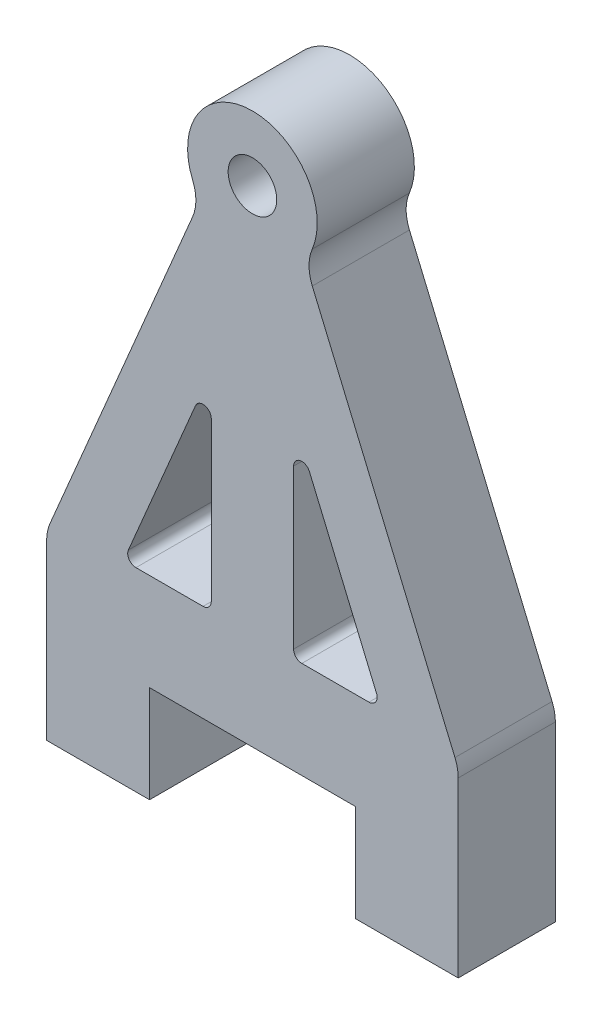
ISO-10303-21;
HEADER;
FILE_DESCRIPTION(('STEP AP214'),'2;1');
FILE_NAME('part.step','',(''),(''),'','','');
FILE_SCHEMA(('AUTOMOTIVE_DESIGN { 1 0 10303 214 1 1 1 1 }'));
ENDSEC;
DATA;
#1=APPLICATION_CONTEXT('core data for automotive mechanical design processes');
#2=APPLICATION_PROTOCOL_DEFINITION('international standard','automotive_design',2000,#1);
#3=PRODUCT_CONTEXT('',#1,'mechanical');
#4=PRODUCT('Part','Part','',(#3));
#5=PRODUCT_RELATED_PRODUCT_CATEGORY('part','',(#4));
#6=PRODUCT_DEFINITION_FORMATION('','',#4);
#7=PRODUCT_DEFINITION_CONTEXT('part definition',#1,'design');
#8=PRODUCT_DEFINITION('design','',#6,#7);
#9=PRODUCT_DEFINITION_SHAPE('','',#8);
#10=(LENGTH_UNIT() NAMED_UNIT(*) SI_UNIT(.MILLI.,.METRE.));
#11=(NAMED_UNIT(*) PLANE_ANGLE_UNIT() SI_UNIT($,.RADIAN.));
#12=(NAMED_UNIT(*) SI_UNIT($,.STERADIAN.) SOLID_ANGLE_UNIT());
#13=UNCERTAINTY_MEASURE_WITH_UNIT(LENGTH_MEASURE(1.E-05),#10,'distance_accuracy_value','');
#14=(GEOMETRIC_REPRESENTATION_CONTEXT(3) GLOBAL_UNCERTAINTY_ASSIGNED_CONTEXT((#13)) GLOBAL_UNIT_ASSIGNED_CONTEXT((#10,
#11,#12)) REPRESENTATION_CONTEXT('',''));
#15=CARTESIAN_POINT('',(0.,0.,0.));
#16=DIRECTION('',(0.,0.,1.));
#17=DIRECTION('',(1.,0.,0.));
#18=AXIS2_PLACEMENT_3D('',#15,#16,#17);
#19=CARTESIAN_POINT('',(-6.03331121194558,-2.52403562173988,5.9944));
#20=DIRECTION('',(0.,0.,1.));
#21=DIRECTION('',(1.,0.,0.));
#22=AXIS2_PLACEMENT_3D('',#19,#20,#21);
#23=PLANE('',#22);
#24=CARTESIAN_POINT('',(-6.03331121194558,-2.52403562173988,5.9944));
#25=DIRECTION('',(0.,0.,-1.));
#26=DIRECTION('',(1.,0.,0.));
#27=AXIS2_PLACEMENT_3D('',#24,#25,#26);
#28=CIRCLE('',#27,2.54);
#29=CARTESIAN_POINT('',(-3.69009860057833,-1.54375267384702,5.9944));
#30=VERTEX_POINT('',#29);
#31=CARTESIAN_POINT('',(-3.69426966875646,-3.51422987502327,5.9944));
#32=VERTEX_POINT('',#31);
#33=EDGE_CURVE('E308',#30,#32,#28,.T.);
#34=ORIENTED_EDGE('',*,*,#33,.T.);
#35=DIRECTION('',(-0.389840257198186,-0.920882497318551,0.));
#36=VECTOR('',#35,1.);
#37=CARTESIAN_POINT('',(-3.69426966875646,-3.51422987502327,5.9944));
#38=LINE('',#37,#36);
#39=CARTESIAN_POINT('',(-12.4990415431891,-24.3129035941556,5.9944));
#40=VERTEX_POINT('',#39);
#41=EDGE_CURVE('E311',#32,#40,#38,.T.);
#42=ORIENTED_EDGE('',*,*,#41,.T.);
#43=CARTESIAN_POINT('',(-10.16,-25.303097847439,5.9944));
#44=DIRECTION('',(0.,0.,1.));
#45=DIRECTION('',(1.,0.,0.));
#46=AXIS2_PLACEMENT_3D('',#43,#44,#45);
#47=CIRCLE('',#46,2.54);
#48=CARTESIAN_POINT('',(-12.7,-25.303097847439,5.9944));
#49=VERTEX_POINT('',#48);
#50=EDGE_CURVE('E314',#40,#49,#47,.T.);
#51=ORIENTED_EDGE('',*,*,#50,.T.);
#52=DIRECTION('',(0.,-1.,0.));
#53=VECTOR('',#52,1.);
#54=CARTESIAN_POINT('',(-12.7,-25.303097847439,5.9944));
#55=LINE('',#54,#53);
#56=CARTESIAN_POINT('',(-12.7,-35.9944,5.9944));
#57=VERTEX_POINT('',#56);
#58=EDGE_CURVE('E316',#49,#57,#55,.T.);
#59=ORIENTED_EDGE('',*,*,#58,.T.);
#60=DIRECTION('',(1.,0.,0.));
#61=VECTOR('',#60,1.);
#62=CARTESIAN_POINT('',(-12.7,-35.9944,5.9944));
#63=LINE('',#62,#61);
#64=CARTESIAN_POINT('',(-6.35000000000001,-35.9944,5.9944));
#65=VERTEX_POINT('',#64);
#66=EDGE_CURVE('E318',#57,#65,#63,.T.);
#67=ORIENTED_EDGE('',*,*,#66,.T.);
#68=DIRECTION('',(0.,1.,0.));
#69=VECTOR('',#68,1.);
#70=CARTESIAN_POINT('',(-6.35000000000001,-35.9944,5.9944));
#71=LINE('',#70,#69);
#72=CARTESIAN_POINT('',(-6.35000000000001,-30.,5.9944));
#73=VERTEX_POINT('',#72);
#74=EDGE_CURVE('E320',#65,#73,#71,.T.);
#75=ORIENTED_EDGE('',*,*,#74,.T.);
#76=DIRECTION('',(1.,0.,0.));
#77=VECTOR('',#76,1.);
#78=CARTESIAN_POINT('',(-6.35000000000001,-30.,5.9944));
#79=LINE('',#78,#77);
#80=CARTESIAN_POINT('',(6.35,-30.,5.9944));
#81=VERTEX_POINT('',#80);
#82=EDGE_CURVE('E322',#73,#81,#79,.T.);
#83=ORIENTED_EDGE('',*,*,#82,.T.);
#84=DIRECTION('',(0.,-1.,0.));
#85=VECTOR('',#84,1.);
#86=CARTESIAN_POINT('',(6.35,-35.9944,5.9944));
#87=LINE('',#86,#85);
#88=CARTESIAN_POINT('',(6.35,-35.9944,5.9944));
#89=VERTEX_POINT('',#88);
#90=EDGE_CURVE('E324',#81,#89,#87,.T.);
#91=ORIENTED_EDGE('',*,*,#90,.T.);
#92=DIRECTION('',(1.,0.,0.));
#93=VECTOR('',#92,1.);
#94=CARTESIAN_POINT('',(12.7,-35.9944,5.9944));
#95=LINE('',#94,#93);
#96=CARTESIAN_POINT('',(12.7,-35.9944,5.9944));
#97=VERTEX_POINT('',#96);
#98=EDGE_CURVE('E326',#89,#97,#95,.T.);
#99=ORIENTED_EDGE('',*,*,#98,.T.);
#100=DIRECTION('',(0.,1.,0.));
#101=VECTOR('',#100,1.);
#102=CARTESIAN_POINT('',(12.7,-30.,5.9944));
#103=LINE('',#102,#101);
#104=CARTESIAN_POINT('',(12.7,-25.303097847439,5.9944));
#105=VERTEX_POINT('',#104);
#106=EDGE_CURVE('E328',#97,#105,#103,.T.);
#107=ORIENTED_EDGE('',*,*,#106,.T.);
#108=CARTESIAN_POINT('',(10.16,-25.303097847439,5.9944));
#109=DIRECTION('',(0.,0.,1.));
#110=DIRECTION('',(-1.,0.,0.));
#111=AXIS2_PLACEMENT_3D('',#108,#109,#110);
#112=CIRCLE('',#111,2.54);
#113=CARTESIAN_POINT('',(12.4990415431891,-24.3129035941556,5.9944));
#114=VERTEX_POINT('',#113);
#115=EDGE_CURVE('E330',#105,#114,#112,.T.);
#116=ORIENTED_EDGE('',*,*,#115,.T.);
#117=DIRECTION('',(-0.389840257198187,0.920882497318551,0.));
#118=VECTOR('',#117,1.);
#119=CARTESIAN_POINT('',(3.69426966875645,-3.51422987502327,5.9944));
#120=LINE('',#119,#118);
#121=CARTESIAN_POINT('',(3.69426966875645,-3.51422987502327,5.9944));
#122=VERTEX_POINT('',#121);
#123=EDGE_CURVE('E332',#114,#122,#120,.T.);
#124=ORIENTED_EDGE('',*,*,#123,.T.);
#125=CARTESIAN_POINT('',(6.03331121194558,-2.52403562173987,5.9944));
#126=DIRECTION('',(0.,0.,-1.));
#127=DIRECTION('',(-1.,0.,0.));
#128=AXIS2_PLACEMENT_3D('',#125,#126,#127);
#129=CIRCLE('',#128,2.54);
#130=CARTESIAN_POINT('',(3.69009860057833,-1.54375267384702,5.9944));
#131=VERTEX_POINT('',#130);
#132=EDGE_CURVE('E334',#122,#131,#129,.T.);
#133=ORIENTED_EDGE('',*,*,#132,.T.);
#134=CARTESIAN_POINT('',(0.,0.,5.9944));
#135=DIRECTION('',(0.,0.,1.));
#136=DIRECTION('',(1.,0.,0.));
#137=AXIS2_PLACEMENT_3D('',#134,#135,#136);
#138=CIRCLE('',#137,4.);
#139=EDGE_CURVE('E336',#131,#30,#138,.T.);
#140=ORIENTED_EDGE('',*,*,#139,.T.);
#141=EDGE_LOOP('',(#34,#42,#51,#59,#67,#75,#83,#91,#99,#107,#116,#124,#133,#140));
#142=FACE_BOUND('',#141,.T.);
#143=CARTESIAN_POINT('',(0.,0.,5.9944));
#144=DIRECTION('',(0.,0.,1.));
#145=DIRECTION('',(1.,0.,0.));
#146=AXIS2_PLACEMENT_3D('',#143,#144,#145);
#147=CIRCLE('',#146,1.5);
#148=CARTESIAN_POINT('',(1.5,0.,5.9944));
#149=VERTEX_POINT('',#148);
#150=EDGE_CURVE('E302',#149,#149,#147,.T.);
#151=ORIENTED_EDGE('',*,*,#150,.F.);
#152=EDGE_LOOP('',(#151));
#153=FACE_BOUND('',#152,.T.);
#154=DIRECTION('',(-0.389840257198187,-0.920882497318551,0.));
#155=VECTOR('',#154,1.);
#156=CARTESIAN_POINT('',(-3.51580830863784,-13.5174503865381,5.9944));
#157=LINE('',#156,#155);
#158=CARTESIAN_POINT('',(-3.51580830863784,-13.5174503865381,5.9944));
#159=VERTEX_POINT('',#158);
#160=CARTESIAN_POINT('',(-7.65690186489207,-23.2995611493433,5.9944));
#161=VERTEX_POINT('',#160);
#162=EDGE_CURVE('E259',#159,#161,#157,.T.);
#163=ORIENTED_EDGE('',*,*,#162,.F.);
#164=CARTESIAN_POINT('',(-3.048,-13.7154892371947,5.9944));
#165=DIRECTION('',(0.,0.,1.));
#166=DIRECTION('',(1.,0.,0.));
#167=AXIS2_PLACEMENT_3D('',#164,#165,#166);
#168=CIRCLE('',#167,0.508);
#169=CARTESIAN_POINT('',(-2.54,-13.7154892371947,5.9944));
#170=VERTEX_POINT('',#169);
#171=EDGE_CURVE('E257',#170,#159,#168,.T.);
#172=ORIENTED_EDGE('',*,*,#171,.F.);
#173=DIRECTION('',(0.,1.,0.));
#174=VECTOR('',#173,1.);
#175=CARTESIAN_POINT('',(-2.54,-13.7154892371947,5.9944));
#176=LINE('',#175,#174);
#177=CARTESIAN_POINT('',(-2.54,-23.4976,5.9944));
#178=VERTEX_POINT('',#177);
#179=EDGE_CURVE('E269',#178,#170,#176,.T.);
#180=ORIENTED_EDGE('',*,*,#179,.F.);
#181=CARTESIAN_POINT('',(-3.048,-23.4976,5.9944));
#182=DIRECTION('',(0.,0.,1.));
#183=DIRECTION('',(1.,0.,0.));
#184=AXIS2_PLACEMENT_3D('',#181,#182,#183);
#185=CIRCLE('',#184,0.507999999999999);
#186=CARTESIAN_POINT('',(-3.048,-24.0056,5.9944));
#187=VERTEX_POINT('',#186);
#188=EDGE_CURVE('E266',#187,#178,#185,.T.);
#189=ORIENTED_EDGE('',*,*,#188,.F.);
#190=DIRECTION('',(1.,0.,0.));
#191=VECTOR('',#190,1.);
#192=CARTESIAN_POINT('',(-3.048,-24.0056,5.9944));
#193=LINE('',#192,#191);
#194=CARTESIAN_POINT('',(-7.18909355625424,-24.0056,5.9944));
#195=VERTEX_POINT('',#194);
#196=EDGE_CURVE('E264',#195,#187,#193,.T.);
#197=ORIENTED_EDGE('',*,*,#196,.F.);
#198=CARTESIAN_POINT('',(-7.18909355625424,-23.4976,5.9944));
#199=DIRECTION('',(0.,0.,1.));
#200=DIRECTION('',(1.,0.,0.));
#201=AXIS2_PLACEMENT_3D('',#198,#199,#200);
#202=CIRCLE('',#201,0.508);
#203=EDGE_CURVE('E262',#161,#195,#202,.T.);
#204=ORIENTED_EDGE('',*,*,#203,.F.);
#205=EDGE_LOOP('',(#163,#172,#180,#189,#197,#204));
#206=FACE_BOUND('',#205,.T.);
#207=DIRECTION('',(0.,-1.,0.));
#208=VECTOR('',#207,1.);
#209=CARTESIAN_POINT('',(2.54,-13.7154892371947,5.9944));
#210=LINE('',#209,#208);
#211=CARTESIAN_POINT('',(2.54,-13.7154892371947,5.9944));
#212=VERTEX_POINT('',#211);
#213=CARTESIAN_POINT('',(2.54,-23.4976,5.9944));
#214=VERTEX_POINT('',#213);
#215=EDGE_CURVE('E214',#212,#214,#210,.T.);
#216=ORIENTED_EDGE('',*,*,#215,.F.);
#217=CARTESIAN_POINT('',(3.048,-13.7154892371947,5.9944));
#218=DIRECTION('',(0.,0.,1.));
#219=DIRECTION('',(-1.,0.,0.));
#220=AXIS2_PLACEMENT_3D('',#217,#218,#219);
#221=CIRCLE('',#220,0.508);
#222=CARTESIAN_POINT('',(3.51580830863784,-13.5174503865381,5.9944));
#223=VERTEX_POINT('',#222);
#224=EDGE_CURVE('E206',#223,#212,#221,.T.);
#225=ORIENTED_EDGE('',*,*,#224,.F.);
#226=DIRECTION('',(-0.389840257198187,0.920882497318551,0.));
#227=VECTOR('',#226,1.);
#228=CARTESIAN_POINT('',(3.51580830863784,-13.5174503865381,5.9944));
#229=LINE('',#228,#227);
#230=CARTESIAN_POINT('',(7.65690186489207,-23.2995611493433,5.9944));
#231=VERTEX_POINT('',#230);
#232=EDGE_CURVE('E235',#231,#223,#229,.T.);
#233=ORIENTED_EDGE('',*,*,#232,.F.);
#234=CARTESIAN_POINT('',(7.18909355625424,-23.4976,5.9944));
#235=DIRECTION('',(0.,0.,1.));
#236=DIRECTION('',(-1.,0.,0.));
#237=AXIS2_PLACEMENT_3D('',#234,#235,#236);
#238=CIRCLE('',#237,0.508);
#239=CARTESIAN_POINT('',(7.18909355625424,-24.0056,5.9944));
#240=VERTEX_POINT('',#239);
#241=EDGE_CURVE('E233',#240,#231,#238,.T.);
#242=ORIENTED_EDGE('',*,*,#241,.F.);
#243=DIRECTION('',(1.,0.,0.));
#244=VECTOR('',#243,1.);
#245=CARTESIAN_POINT('',(7.18909355625424,-24.0056,5.9944));
#246=LINE('',#245,#244);
#247=CARTESIAN_POINT('',(3.048,-24.0056,5.9944));
#248=VERTEX_POINT('',#247);
#249=EDGE_CURVE('E229',#248,#240,#246,.T.);
#250=ORIENTED_EDGE('',*,*,#249,.F.);
#251=CARTESIAN_POINT('',(3.048,-23.4976,5.9944));
#252=DIRECTION('',(0.,0.,1.));
#253=DIRECTION('',(1.,0.,0.));
#254=AXIS2_PLACEMENT_3D('',#251,#252,#253);
#255=CIRCLE('',#254,0.507999999999999);
#256=EDGE_CURVE('E227',#214,#248,#255,.T.);
#257=ORIENTED_EDGE('',*,*,#256,.F.);
#258=EDGE_LOOP('',(#216,#225,#233,#242,#250,#257));
#259=FACE_BOUND('',#258,.T.);
#260=ADVANCED_FACE('F33',(#142,#153,#206,#259),#23,.T.);
#261=CARTESIAN_POINT('',(-6.03331121194558,-2.52403562173988,0.));
#262=DIRECTION('',(0.,0.,1.));
#263=DIRECTION('',(1.,0.,0.));
#264=AXIS2_PLACEMENT_3D('',#261,#262,#263);
#265=PLANE('',#264);
#266=CARTESIAN_POINT('',(-3.048,-13.7154892371947,0.));
#267=DIRECTION('',(0.,0.,1.));
#268=DIRECTION('',(1.,0.,0.));
#269=AXIS2_PLACEMENT_3D('',#266,#267,#268);
#270=CIRCLE('',#269,0.508);
#271=CARTESIAN_POINT('',(-2.54,-13.7154892371947,0.));
#272=VERTEX_POINT('',#271);
#273=CARTESIAN_POINT('',(-3.51580830863784,-13.5174503865381,0.));
#274=VERTEX_POINT('',#273);
#275=EDGE_CURVE('E222',#272,#274,#270,.T.);
#276=ORIENTED_EDGE('',*,*,#275,.T.);
#277=DIRECTION('',(-0.389840257198187,-0.920882497318551,0.));
#278=VECTOR('',#277,1.);
#279=CARTESIAN_POINT('',(-3.51580830863784,-13.5174503865381,0.));
#280=LINE('',#279,#278);
#281=CARTESIAN_POINT('',(-7.65690186489207,-23.2995611493433,0.));
#282=VERTEX_POINT('',#281);
#283=EDGE_CURVE('E274',#274,#282,#280,.T.);
#284=ORIENTED_EDGE('',*,*,#283,.T.);
#285=CARTESIAN_POINT('',(-7.18909355625424,-23.4976,0.));
#286=DIRECTION('',(0.,0.,1.));
#287=DIRECTION('',(1.,0.,0.));
#288=AXIS2_PLACEMENT_3D('',#285,#286,#287);
#289=CIRCLE('',#288,0.508);
#290=CARTESIAN_POINT('',(-7.18909355625424,-24.0056,0.));
#291=VERTEX_POINT('',#290);
#292=EDGE_CURVE('E277',#282,#291,#289,.T.);
#293=ORIENTED_EDGE('',*,*,#292,.T.);
#294=DIRECTION('',(1.,0.,0.));
#295=VECTOR('',#294,1.);
#296=CARTESIAN_POINT('',(-3.048,-24.0056,0.));
#297=LINE('',#296,#295);
#298=CARTESIAN_POINT('',(-3.048,-24.0056,0.));
#299=VERTEX_POINT('',#298);
#300=EDGE_CURVE('E280',#291,#299,#297,.T.);
#301=ORIENTED_EDGE('',*,*,#300,.T.);
#302=CARTESIAN_POINT('',(-3.048,-23.4976,0.));
#303=DIRECTION('',(0.,0.,1.));
#304=DIRECTION('',(1.,0.,0.));
#305=AXIS2_PLACEMENT_3D('',#302,#303,#304);
#306=CIRCLE('',#305,0.507999999999999);
#307=CARTESIAN_POINT('',(-2.54,-23.4976,0.));
#308=VERTEX_POINT('',#307);
#309=EDGE_CURVE('E283',#299,#308,#306,.T.);
#310=ORIENTED_EDGE('',*,*,#309,.T.);
#311=DIRECTION('',(0.,1.,0.));
#312=VECTOR('',#311,1.);
#313=CARTESIAN_POINT('',(-2.54,-13.7154892371947,0.));
#314=LINE('',#313,#312);
#315=EDGE_CURVE('E260',#308,#272,#314,.T.);
#316=ORIENTED_EDGE('',*,*,#315,.T.);
#317=EDGE_LOOP('',(#276,#284,#293,#301,#310,#316));
#318=FACE_BOUND('',#317,.T.);
#319=CARTESIAN_POINT('',(-6.03331121194558,-2.52403562173988,0.));
#320=DIRECTION('',(0.,0.,-1.));
#321=DIRECTION('',(1.,0.,0.));
#322=AXIS2_PLACEMENT_3D('',#319,#320,#321);
#323=CIRCLE('',#322,2.54);
#324=CARTESIAN_POINT('',(-3.69009860057833,-1.54375267384702,0.));
#325=VERTEX_POINT('',#324);
#326=CARTESIAN_POINT('',(-3.69426966875646,-3.51422987502327,0.));
#327=VERTEX_POINT('',#326);
#328=EDGE_CURVE('E305',#325,#327,#323,.T.);
#329=ORIENTED_EDGE('',*,*,#328,.F.);
#330=CARTESIAN_POINT('',(0.,0.,0.));
#331=DIRECTION('',(0.,0.,1.));
#332=DIRECTION('',(1.,0.,0.));
#333=AXIS2_PLACEMENT_3D('',#330,#331,#332);
#334=CIRCLE('',#333,4.);
#335=CARTESIAN_POINT('',(3.69009860057833,-1.54375267384702,0.));
#336=VERTEX_POINT('',#335);
#337=EDGE_CURVE('E312',#336,#325,#334,.T.);
#338=ORIENTED_EDGE('',*,*,#337,.F.);
#339=CARTESIAN_POINT('',(6.03331121194558,-2.52403562173987,0.));
#340=DIRECTION('',(0.,0.,-1.));
#341=DIRECTION('',(-1.,0.,0.));
#342=AXIS2_PLACEMENT_3D('',#339,#340,#341);
#343=CIRCLE('',#342,2.54);
#344=CARTESIAN_POINT('',(3.69426966875645,-3.51422987502327,0.));
#345=VERTEX_POINT('',#344);
#346=EDGE_CURVE('E365',#345,#336,#343,.T.);
#347=ORIENTED_EDGE('',*,*,#346,.F.);
#348=DIRECTION('',(-0.389840257198187,0.920882497318551,0.));
#349=VECTOR('',#348,1.);
#350=CARTESIAN_POINT('',(3.69426966875645,-3.51422987502327,0.));
#351=LINE('',#350,#349);
#352=CARTESIAN_POINT('',(12.4990415431891,-24.3129035941556,0.));
#353=VERTEX_POINT('',#352);
#354=EDGE_CURVE('E363',#353,#345,#351,.T.);
#355=ORIENTED_EDGE('',*,*,#354,.F.);
#356=CARTESIAN_POINT('',(10.16,-25.303097847439,0.));
#357=DIRECTION('',(0.,0.,1.));
#358=DIRECTION('',(-1.,0.,0.));
#359=AXIS2_PLACEMENT_3D('',#356,#357,#358);
#360=CIRCLE('',#359,2.54);
#361=CARTESIAN_POINT('',(12.7,-25.303097847439,0.));
#362=VERTEX_POINT('',#361);
#363=EDGE_CURVE('E361',#362,#353,#360,.T.);
#364=ORIENTED_EDGE('',*,*,#363,.F.);
#365=DIRECTION('',(0.,1.,0.));
#366=VECTOR('',#365,1.);
#367=CARTESIAN_POINT('',(12.7,-30.,0.));
#368=LINE('',#367,#366);
#369=CARTESIAN_POINT('',(12.7,-35.9944,0.));
#370=VERTEX_POINT('',#369);
#371=EDGE_CURVE('E359',#370,#362,#368,.T.);
#372=ORIENTED_EDGE('',*,*,#371,.F.);
#373=DIRECTION('',(1.,0.,0.));
#374=VECTOR('',#373,1.);
#375=CARTESIAN_POINT('',(12.7,-35.9944,0.));
#376=LINE('',#375,#374);
#377=CARTESIAN_POINT('',(6.35,-35.9944,0.));
#378=VERTEX_POINT('',#377);
#379=EDGE_CURVE('E356',#378,#370,#376,.T.);
#380=ORIENTED_EDGE('',*,*,#379,.F.);
#381=DIRECTION('',(0.,-1.,0.));
#382=VECTOR('',#381,1.);
#383=CARTESIAN_POINT('',(6.35,-35.9944,0.));
#384=LINE('',#383,#382);
#385=CARTESIAN_POINT('',(6.35,-30.,0.));
#386=VERTEX_POINT('',#385);
#387=EDGE_CURVE('E354',#386,#378,#384,.T.);
#388=ORIENTED_EDGE('',*,*,#387,.F.);
#389=DIRECTION('',(1.,0.,0.));
#390=VECTOR('',#389,1.);
#391=CARTESIAN_POINT('',(-6.35000000000001,-30.,0.));
#392=LINE('',#391,#390);
#393=CARTESIAN_POINT('',(-6.35000000000001,-30.,0.));
#394=VERTEX_POINT('',#393);
#395=EDGE_CURVE('E352',#394,#386,#392,.T.);
#396=ORIENTED_EDGE('',*,*,#395,.F.);
#397=DIRECTION('',(0.,1.,0.));
#398=VECTOR('',#397,1.);
#399=CARTESIAN_POINT('',(-6.35000000000001,-35.9944,0.));
#400=LINE('',#399,#398);
#401=CARTESIAN_POINT('',(-6.35000000000001,-35.9944,0.));
#402=VERTEX_POINT('',#401);
#403=EDGE_CURVE('E350',#402,#394,#400,.T.);
#404=ORIENTED_EDGE('',*,*,#403,.F.);
#405=DIRECTION('',(1.,0.,0.));
#406=VECTOR('',#405,1.);
#407=CARTESIAN_POINT('',(-12.7,-35.9944,0.));
#408=LINE('',#407,#406);
#409=CARTESIAN_POINT('',(-12.7,-35.9944,0.));
#410=VERTEX_POINT('',#409);
#411=EDGE_CURVE('E348',#410,#402,#408,.T.);
#412=ORIENTED_EDGE('',*,*,#411,.F.);
#413=DIRECTION('',(0.,-1.,0.));
#414=VECTOR('',#413,1.);
#415=CARTESIAN_POINT('',(-12.7,-30.,0.));
#416=LINE('',#415,#414);
#417=CARTESIAN_POINT('',(-12.7,-25.303097847439,0.));
#418=VERTEX_POINT('',#417);
#419=EDGE_CURVE('E346',#418,#410,#416,.T.);
#420=ORIENTED_EDGE('',*,*,#419,.F.);
#421=CARTESIAN_POINT('',(-10.16,-25.303097847439,0.));
#422=DIRECTION('',(0.,0.,1.));
#423=DIRECTION('',(1.,0.,0.));
#424=AXIS2_PLACEMENT_3D('',#421,#422,#423);
#425=CIRCLE('',#424,2.54);
#426=CARTESIAN_POINT('',(-12.4990415431891,-24.3129035941556,0.));
#427=VERTEX_POINT('',#426);
#428=EDGE_CURVE('E343',#427,#418,#425,.T.);
#429=ORIENTED_EDGE('',*,*,#428,.F.);
#430=DIRECTION('',(-0.389840257198186,-0.920882497318551,0.));
#431=VECTOR('',#430,1.);
#432=CARTESIAN_POINT('',(-3.69426966875646,-3.51422987502327,0.));
#433=LINE('',#432,#431);
#434=EDGE_CURVE('E341',#327,#427,#433,.T.);
#435=ORIENTED_EDGE('',*,*,#434,.F.);
#436=EDGE_LOOP('',(#329,#338,#347,#355,#364,#372,#380,#388,#396,#404,#412,#420,#429,#435));
#437=FACE_BOUND('',#436,.T.);
#438=CARTESIAN_POINT('',(0.,0.,0.));
#439=DIRECTION('',(0.,0.,1.));
#440=DIRECTION('',(1.,0.,0.));
#441=AXIS2_PLACEMENT_3D('',#438,#439,#440);
#442=CIRCLE('',#441,1.5);
#443=CARTESIAN_POINT('',(1.5,0.,0.));
#444=VERTEX_POINT('',#443);
#445=EDGE_CURVE('E301',#444,#444,#442,.T.);
#446=ORIENTED_EDGE('',*,*,#445,.T.);
#447=EDGE_LOOP('',(#446));
#448=FACE_BOUND('',#447,.T.);
#449=CARTESIAN_POINT('',(3.048,-13.7154892371947,0.));
#450=DIRECTION('',(0.,0.,1.));
#451=DIRECTION('',(-1.,0.,0.));
#452=AXIS2_PLACEMENT_3D('',#449,#450,#451);
#453=CIRCLE('',#452,0.508);
#454=CARTESIAN_POINT('',(3.51580830863784,-13.5174503865381,0.));
#455=VERTEX_POINT('',#454);
#456=CARTESIAN_POINT('',(2.54,-13.7154892371947,0.));
#457=VERTEX_POINT('',#456);
#458=EDGE_CURVE('E56',#455,#457,#453,.T.);
#459=ORIENTED_EDGE('',*,*,#458,.T.);
#460=DIRECTION('',(0.,-1.,0.));
#461=VECTOR('',#460,1.);
#462=CARTESIAN_POINT('',(2.54,-13.7154892371947,0.));
#463=LINE('',#462,#461);
#464=CARTESIAN_POINT('',(2.54,-23.4976,0.));
#465=VERTEX_POINT('',#464);
#466=EDGE_CURVE('E221',#457,#465,#463,.T.);
#467=ORIENTED_EDGE('',*,*,#466,.T.);
#468=CARTESIAN_POINT('',(3.048,-23.4976,0.));
#469=DIRECTION('',(0.,0.,1.));
#470=DIRECTION('',(1.,0.,0.));
#471=AXIS2_PLACEMENT_3D('',#468,#469,#470);
#472=CIRCLE('',#471,0.507999999999999);
#473=CARTESIAN_POINT('',(3.048,-24.0056,0.));
#474=VERTEX_POINT('',#473);
#475=EDGE_CURVE('E239',#465,#474,#472,.T.);
#476=ORIENTED_EDGE('',*,*,#475,.T.);
#477=DIRECTION('',(1.,0.,0.));
#478=VECTOR('',#477,1.);
#479=CARTESIAN_POINT('',(7.18909355625424,-24.0056,0.));
#480=LINE('',#479,#478);
#481=CARTESIAN_POINT('',(7.18909355625424,-24.0056,0.));
#482=VERTEX_POINT('',#481);
#483=EDGE_CURVE('E242',#474,#482,#480,.T.);
#484=ORIENTED_EDGE('',*,*,#483,.T.);
#485=CARTESIAN_POINT('',(7.18909355625424,-23.4976,0.));
#486=DIRECTION('',(0.,0.,1.));
#487=DIRECTION('',(-1.,0.,0.));
#488=AXIS2_PLACEMENT_3D('',#485,#486,#487);
#489=CIRCLE('',#488,0.508);
#490=CARTESIAN_POINT('',(7.65690186489207,-23.2995611493433,0.));
#491=VERTEX_POINT('',#490);
#492=EDGE_CURVE('E245',#482,#491,#489,.T.);
#493=ORIENTED_EDGE('',*,*,#492,.T.);
#494=DIRECTION('',(-0.389840257198187,0.920882497318551,0.));
#495=VECTOR('',#494,1.);
#496=CARTESIAN_POINT('',(3.51580830863784,-13.5174503865381,0.));
#497=LINE('',#496,#495);
#498=EDGE_CURVE('E215',#491,#455,#497,.T.);
#499=ORIENTED_EDGE('',*,*,#498,.T.);
#500=EDGE_LOOP('',(#459,#467,#476,#484,#493,#499));
#501=FACE_BOUND('',#500,.T.);
#502=ADVANCED_FACE('F412',(#318,#437,#448,#501),#265,.F.);
#503=CARTESIAN_POINT('',(-6.03331121194558,-2.52403562173988,5.9944));
#504=DIRECTION('',(0.,0.,-1.));
#505=DIRECTION('',(-1.,0.,0.));
#506=AXIS2_PLACEMENT_3D('',#503,#504,#505);
#507=CYLINDRICAL_SURFACE('',#506,2.54);
#508=ORIENTED_EDGE('',*,*,#328,.T.);
#509=DIRECTION('',(0.,0.,-1.));
#510=VECTOR('',#509,1.);
#511=CARTESIAN_POINT('',(-3.69426966875646,-3.51422987502327,5.9944));
#512=LINE('',#511,#510);
#513=EDGE_CURVE('E11',#32,#327,#512,.T.);
#514=ORIENTED_EDGE('',*,*,#513,.F.);
#515=ORIENTED_EDGE('',*,*,#33,.F.);
#516=DIRECTION('',(0.,0.,-1.));
#517=VECTOR('',#516,1.);
#518=CARTESIAN_POINT('',(-3.69009860057833,-1.54375267384702,5.9944));
#519=LINE('',#518,#517);
#520=EDGE_CURVE('E338',#30,#325,#519,.T.);
#521=ORIENTED_EDGE('',*,*,#520,.T.);
#522=EDGE_LOOP('',(#508,#514,#515,#521));
#523=FACE_BOUND('',#522,.T.);
#524=ADVANCED_FACE('F35',(#523),#507,.F.);
#525=CARTESIAN_POINT('',(-3.69426966875646,-3.51422987502327,5.9944));
#526=DIRECTION('',(0.920882497318551,-0.389840257198186,0.));
#527=DIRECTION('',(0.389840257198186,0.920882497318551,0.));
#528=AXIS2_PLACEMENT_3D('',#525,#526,#527);
#529=PLANE('',#528);
#530=ORIENTED_EDGE('',*,*,#434,.T.);
#531=DIRECTION('',(0.,0.,-1.));
#532=VECTOR('',#531,1.);
#533=CARTESIAN_POINT('',(-12.4990415431891,-24.3129035941556,5.9944));
#534=LINE('',#533,#532);
#535=EDGE_CURVE('E41',#40,#427,#534,.T.);
#536=ORIENTED_EDGE('',*,*,#535,.F.);
#537=ORIENTED_EDGE('',*,*,#41,.F.);
#538=ORIENTED_EDGE('',*,*,#513,.T.);
#539=EDGE_LOOP('',(#530,#536,#537,#538));
#540=FACE_BOUND('',#539,.T.);
#541=ADVANCED_FACE('F430',(#540),#529,.F.);
#542=CARTESIAN_POINT('',(-10.16,-25.303097847439,5.9944));
#543=DIRECTION('',(0.,0.,-1.));
#544=DIRECTION('',(-1.,0.,0.));
#545=AXIS2_PLACEMENT_3D('',#542,#543,#544);
#546=CYLINDRICAL_SURFACE('',#545,2.54);
#547=ORIENTED_EDGE('',*,*,#428,.T.);
#548=DIRECTION('',(0.,0.,-1.));
#549=VECTOR('',#548,1.);
#550=CARTESIAN_POINT('',(-12.7,-25.303097847439,5.9944));
#551=LINE('',#550,#549);
#552=EDGE_CURVE('E400',#49,#418,#551,.T.);
#553=ORIENTED_EDGE('',*,*,#552,.F.);
#554=ORIENTED_EDGE('',*,*,#50,.F.);
#555=ORIENTED_EDGE('',*,*,#535,.T.);
#556=EDGE_LOOP('',(#547,#553,#554,#555));
#557=FACE_BOUND('',#556,.T.);
#558=ADVANCED_FACE('F407',(#557),#546,.T.);
#559=CARTESIAN_POINT('',(-12.7,-30.,5.9944));
#560=DIRECTION('',(1.,0.,0.));
#561=DIRECTION('',(0.,1.,0.));
#562=AXIS2_PLACEMENT_3D('',#559,#560,#561);
#563=PLANE('',#562);
#564=ORIENTED_EDGE('',*,*,#419,.T.);
#565=DIRECTION('',(0.,0.,-1.));
#566=VECTOR('',#565,1.);
#567=CARTESIAN_POINT('',(-12.7,-35.9944,5.9944));
#568=LINE('',#567,#566);
#569=EDGE_CURVE('E397',#57,#410,#568,.T.);
#570=ORIENTED_EDGE('',*,*,#569,.F.);
#571=ORIENTED_EDGE('',*,*,#58,.F.);
#572=ORIENTED_EDGE('',*,*,#552,.T.);
#573=EDGE_LOOP('',(#564,#570,#571,#572));
#574=FACE_BOUND('',#573,.T.);
#575=ADVANCED_FACE('F418',(#574),#563,.F.);
#576=CARTESIAN_POINT('',(-12.7,-35.9944,5.9944));
#577=DIRECTION('',(0.,1.,0.));
#578=DIRECTION('',(0.,0.,1.));
#579=AXIS2_PLACEMENT_3D('',#576,#577,#578);
#580=PLANE('',#579);
#581=ORIENTED_EDGE('',*,*,#411,.T.);
#582=DIRECTION('',(0.,0.,-1.));
#583=VECTOR('',#582,1.);
#584=CARTESIAN_POINT('',(-6.35000000000001,-35.9944,5.9944));
#585=LINE('',#584,#583);
#586=EDGE_CURVE('E394',#65,#402,#585,.T.);
#587=ORIENTED_EDGE('',*,*,#586,.F.);
#588=ORIENTED_EDGE('',*,*,#66,.F.);
#589=ORIENTED_EDGE('',*,*,#569,.T.);
#590=EDGE_LOOP('',(#581,#587,#588,#589));
#591=FACE_BOUND('',#590,.T.);
#592=ADVANCED_FACE('F422',(#591),#580,.F.);
#593=CARTESIAN_POINT('',(-6.35000000000001,-35.9944,5.9944));
#594=DIRECTION('',(-1.,0.,0.));
#595=DIRECTION('',(0.,0.,1.));
#596=AXIS2_PLACEMENT_3D('',#593,#594,#595);
#597=PLANE('',#596);
#598=ORIENTED_EDGE('',*,*,#403,.T.);
#599=DIRECTION('',(0.,0.,-1.));
#600=VECTOR('',#599,1.);
#601=CARTESIAN_POINT('',(-6.35000000000001,-30.,5.9944));
#602=LINE('',#601,#600);
#603=EDGE_CURVE('E391',#73,#394,#602,.T.);
#604=ORIENTED_EDGE('',*,*,#603,.F.);
#605=ORIENTED_EDGE('',*,*,#74,.F.);
#606=ORIENTED_EDGE('',*,*,#586,.T.);
#607=EDGE_LOOP('',(#598,#604,#605,#606));
#608=FACE_BOUND('',#607,.T.);
#609=ADVANCED_FACE('F472',(#608),#597,.F.);
#610=CARTESIAN_POINT('',(-6.35000000000001,-30.,5.9944));
#611=DIRECTION('',(0.,1.,0.));
#612=DIRECTION('',(-1.,0.,0.));
#613=AXIS2_PLACEMENT_3D('',#610,#611,#612);
#614=PLANE('',#613);
#615=ORIENTED_EDGE('',*,*,#395,.T.);
#616=DIRECTION('',(0.,0.,-1.));
#617=VECTOR('',#616,1.);
#618=CARTESIAN_POINT('',(6.35,-30.,5.9944));
#619=LINE('',#618,#617);
#620=EDGE_CURVE('E388',#81,#386,#619,.T.);
#621=ORIENTED_EDGE('',*,*,#620,.F.);
#622=ORIENTED_EDGE('',*,*,#82,.F.);
#623=ORIENTED_EDGE('',*,*,#603,.T.);
#624=EDGE_LOOP('',(#615,#621,#622,#623));
#625=FACE_BOUND('',#624,.T.);
#626=ADVANCED_FACE('F470',(#625),#614,.F.);
#627=CARTESIAN_POINT('',(6.35,-35.9944,5.9944));
#628=DIRECTION('',(1.,0.,0.));
#629=DIRECTION('',(0.,0.,-1.));
#630=AXIS2_PLACEMENT_3D('',#627,#628,#629);
#631=PLANE('',#630);
#632=ORIENTED_EDGE('',*,*,#387,.T.);
#633=DIRECTION('',(0.,0.,-1.));
#634=VECTOR('',#633,1.);
#635=CARTESIAN_POINT('',(6.35,-35.9944,5.9944));
#636=LINE('',#635,#634);
#637=EDGE_CURVE('E385',#89,#378,#636,.T.);
#638=ORIENTED_EDGE('',*,*,#637,.F.);
#639=ORIENTED_EDGE('',*,*,#90,.F.);
#640=ORIENTED_EDGE('',*,*,#620,.T.);
#641=EDGE_LOOP('',(#632,#638,#639,#640));
#642=FACE_BOUND('',#641,.T.);
#643=ADVANCED_FACE('F465',(#642),#631,.F.);
#644=CARTESIAN_POINT('',(12.7,-35.9944,5.9944));
#645=DIRECTION('',(0.,1.,0.));
#646=DIRECTION('',(0.,0.,1.));
#647=AXIS2_PLACEMENT_3D('',#644,#645,#646);
#648=PLANE('',#647);
#649=ORIENTED_EDGE('',*,*,#379,.T.);
#650=DIRECTION('',(0.,0.,-1.));
#651=VECTOR('',#650,1.);
#652=CARTESIAN_POINT('',(12.7,-35.9944,5.9944));
#653=LINE('',#652,#651);
#654=EDGE_CURVE('E382',#97,#370,#653,.T.);
#655=ORIENTED_EDGE('',*,*,#654,.F.);
#656=ORIENTED_EDGE('',*,*,#98,.F.);
#657=ORIENTED_EDGE('',*,*,#637,.T.);
#658=EDGE_LOOP('',(#649,#655,#656,#657));
#659=FACE_BOUND('',#658,.T.);
#660=ADVANCED_FACE('F460',(#659),#648,.F.);
#661=CARTESIAN_POINT('',(12.7,-30.,5.9944));
#662=DIRECTION('',(-1.,0.,0.));
#663=DIRECTION('',(0.,-1.,0.));
#664=AXIS2_PLACEMENT_3D('',#661,#662,#663);
#665=PLANE('',#664);
#666=ORIENTED_EDGE('',*,*,#371,.T.);
#667=DIRECTION('',(0.,0.,-1.));
#668=VECTOR('',#667,1.);
#669=CARTESIAN_POINT('',(12.7,-25.303097847439,5.9944));
#670=LINE('',#669,#668);
#671=EDGE_CURVE('E379',#105,#362,#670,.T.);
#672=ORIENTED_EDGE('',*,*,#671,.F.);
#673=ORIENTED_EDGE('',*,*,#106,.F.);
#674=ORIENTED_EDGE('',*,*,#654,.T.);
#675=EDGE_LOOP('',(#666,#672,#673,#674));
#676=FACE_BOUND('',#675,.T.);
#677=ADVANCED_FACE('F456',(#676),#665,.F.);
#678=CARTESIAN_POINT('',(10.16,-25.303097847439,5.9944));
#679=DIRECTION('',(0.,0.,-1.));
#680=DIRECTION('',(-1.,0.,0.));
#681=AXIS2_PLACEMENT_3D('',#678,#679,#680);
#682=CYLINDRICAL_SURFACE('',#681,2.54);
#683=ORIENTED_EDGE('',*,*,#363,.T.);
#684=DIRECTION('',(0.,0.,-1.));
#685=VECTOR('',#684,1.);
#686=CARTESIAN_POINT('',(12.4990415431891,-24.3129035941556,5.9944));
#687=LINE('',#686,#685);
#688=EDGE_CURVE('E376',#114,#353,#687,.T.);
#689=ORIENTED_EDGE('',*,*,#688,.F.);
#690=ORIENTED_EDGE('',*,*,#115,.F.);
#691=ORIENTED_EDGE('',*,*,#671,.T.);
#692=EDGE_LOOP('',(#683,#689,#690,#691));
#693=FACE_BOUND('',#692,.T.);
#694=ADVANCED_FACE('F451',(#693),#682,.T.);
#695=CARTESIAN_POINT('',(3.69426966875645,-3.51422987502327,5.9944));
#696=DIRECTION('',(-0.920882497318551,-0.389840257198187,0.));
#697=DIRECTION('',(0.389840257198187,-0.920882497318551,0.));
#698=AXIS2_PLACEMENT_3D('',#695,#696,#697);
#699=PLANE('',#698);
#700=ORIENTED_EDGE('',*,*,#354,.T.);
#701=DIRECTION('',(0.,0.,-1.));
#702=VECTOR('',#701,1.);
#703=CARTESIAN_POINT('',(3.69426966875645,-3.51422987502327,5.9944));
#704=LINE('',#703,#702);
#705=EDGE_CURVE('E373',#122,#345,#704,.T.);
#706=ORIENTED_EDGE('',*,*,#705,.F.);
#707=ORIENTED_EDGE('',*,*,#123,.F.);
#708=ORIENTED_EDGE('',*,*,#688,.T.);
#709=EDGE_LOOP('',(#700,#706,#707,#708));
#710=FACE_BOUND('',#709,.T.);
#711=ADVANCED_FACE('F446',(#710),#699,.F.);
#712=CARTESIAN_POINT('',(6.03331121194558,-2.52403562173987,5.9944));
#713=DIRECTION('',(0.,0.,-1.));
#714=DIRECTION('',(-1.,0.,0.));
#715=AXIS2_PLACEMENT_3D('',#712,#713,#714);
#716=CYLINDRICAL_SURFACE('',#715,2.54);
#717=ORIENTED_EDGE('',*,*,#346,.T.);
#718=DIRECTION('',(0.,0.,-1.));
#719=VECTOR('',#718,1.);
#720=CARTESIAN_POINT('',(3.69009860057833,-1.54375267384702,5.9944));
#721=LINE('',#720,#719);
#722=EDGE_CURVE('E370',#131,#336,#721,.T.);
#723=ORIENTED_EDGE('',*,*,#722,.F.);
#724=ORIENTED_EDGE('',*,*,#132,.F.);
#725=ORIENTED_EDGE('',*,*,#705,.T.);
#726=EDGE_LOOP('',(#717,#723,#724,#725));
#727=FACE_BOUND('',#726,.T.);
#728=ADVANCED_FACE('F442',(#727),#716,.F.);
#729=CARTESIAN_POINT('',(0.,0.,5.9944));
#730=DIRECTION('',(0.,0.,-1.));
#731=DIRECTION('',(-1.,0.,0.));
#732=AXIS2_PLACEMENT_3D('',#729,#730,#731);
#733=CYLINDRICAL_SURFACE('',#732,4.);
#734=ORIENTED_EDGE('',*,*,#337,.T.);
#735=ORIENTED_EDGE('',*,*,#520,.F.);
#736=ORIENTED_EDGE('',*,*,#139,.F.);
#737=ORIENTED_EDGE('',*,*,#722,.T.);
#738=EDGE_LOOP('',(#734,#735,#736,#737));
#739=FACE_BOUND('',#738,.T.);
#740=ADVANCED_FACE('F437',(#739),#733,.T.);
#741=CARTESIAN_POINT('',(0.,0.,5.9944));
#742=DIRECTION('',(0.,0.,-1.));
#743=DIRECTION('',(-1.,0.,0.));
#744=AXIS2_PLACEMENT_3D('',#741,#742,#743);
#745=CYLINDRICAL_SURFACE('',#744,1.5);
#746=ORIENTED_EDGE('',*,*,#150,.T.);
#747=EDGE_LOOP('',(#746));
#748=FACE_BOUND('',#747,.T.);
#749=ORIENTED_EDGE('',*,*,#445,.F.);
#750=EDGE_LOOP('',(#749));
#751=FACE_BOUND('',#750,.T.);
#752=ADVANCED_FACE('F489',(#748,#751),#745,.F.);
#753=CARTESIAN_POINT('',(-3.048,-13.7154892371947,5.9944));
#754=DIRECTION('',(0.,0.,-1.));
#755=DIRECTION('',(-1.,0.,0.));
#756=AXIS2_PLACEMENT_3D('',#753,#754,#755);
#757=CYLINDRICAL_SURFACE('',#756,0.508);
#758=ORIENTED_EDGE('',*,*,#275,.F.);
#759=DIRECTION('',(0.,0.,-1.));
#760=VECTOR('',#759,1.);
#761=CARTESIAN_POINT('',(-2.54,-13.7154892371947,5.9944));
#762=LINE('',#761,#760);
#763=EDGE_CURVE('E271',#170,#272,#762,.T.);
#764=ORIENTED_EDGE('',*,*,#763,.F.);
#765=ORIENTED_EDGE('',*,*,#171,.T.);
#766=DIRECTION('',(0.,0.,-1.));
#767=VECTOR('',#766,1.);
#768=CARTESIAN_POINT('',(-3.51580830863784,-13.5174503865381,5.9944));
#769=LINE('',#768,#767);
#770=EDGE_CURVE('E298',#159,#274,#769,.T.);
#771=ORIENTED_EDGE('',*,*,#770,.T.);
#772=EDGE_LOOP('',(#758,#764,#765,#771));
#773=FACE_BOUND('',#772,.T.);
#774=ADVANCED_FACE('F539',(#773),#757,.F.);
#775=CARTESIAN_POINT('',(-3.51580830863784,-13.5174503865381,5.9944));
#776=DIRECTION('',(0.920882497318551,-0.389840257198187,0.));
#777=DIRECTION('',(0.389840257198187,0.920882497318551,0.));
#778=AXIS2_PLACEMENT_3D('',#775,#776,#777);
#779=PLANE('',#778);
#780=ORIENTED_EDGE('',*,*,#283,.F.);
#781=ORIENTED_EDGE('',*,*,#770,.F.);
#782=ORIENTED_EDGE('',*,*,#162,.T.);
#783=DIRECTION('',(0.,0.,-1.));
#784=VECTOR('',#783,1.);
#785=CARTESIAN_POINT('',(-7.65690186489207,-23.2995611493433,5.9944));
#786=LINE('',#785,#784);
#787=EDGE_CURVE('E296',#161,#282,#786,.T.);
#788=ORIENTED_EDGE('',*,*,#787,.T.);
#789=EDGE_LOOP('',(#780,#781,#782,#788));
#790=FACE_BOUND('',#789,.T.);
#791=ADVANCED_FACE('F546',(#790),#779,.T.);
#792=CARTESIAN_POINT('',(-7.18909355625424,-23.4976,5.9944));
#793=DIRECTION('',(0.,0.,-1.));
#794=DIRECTION('',(-1.,0.,0.));
#795=AXIS2_PLACEMENT_3D('',#792,#793,#794);
#796=CYLINDRICAL_SURFACE('',#795,0.508);
#797=ORIENTED_EDGE('',*,*,#292,.F.);
#798=ORIENTED_EDGE('',*,*,#787,.F.);
#799=ORIENTED_EDGE('',*,*,#203,.T.);
#800=DIRECTION('',(0.,0.,-1.));
#801=VECTOR('',#800,1.);
#802=CARTESIAN_POINT('',(-7.18909355625424,-24.0056,5.9944));
#803=LINE('',#802,#801);
#804=EDGE_CURVE('E294',#195,#291,#803,.T.);
#805=ORIENTED_EDGE('',*,*,#804,.T.);
#806=EDGE_LOOP('',(#797,#798,#799,#805));
#807=FACE_BOUND('',#806,.T.);
#808=ADVANCED_FACE('F553',(#807),#796,.F.);
#809=CARTESIAN_POINT('',(-3.048,-24.0056,5.9944));
#810=DIRECTION('',(0.,1.,0.));
#811=DIRECTION('',(-1.,0.,0.));
#812=AXIS2_PLACEMENT_3D('',#809,#810,#811);
#813=PLANE('',#812);
#814=ORIENTED_EDGE('',*,*,#300,.F.);
#815=ORIENTED_EDGE('',*,*,#804,.F.);
#816=ORIENTED_EDGE('',*,*,#196,.T.);
#817=DIRECTION('',(0.,0.,-1.));
#818=VECTOR('',#817,1.);
#819=CARTESIAN_POINT('',(-3.048,-24.0056,5.9944));
#820=LINE('',#819,#818);
#821=EDGE_CURVE('E292',#187,#299,#820,.T.);
#822=ORIENTED_EDGE('',*,*,#821,.T.);
#823=EDGE_LOOP('',(#814,#815,#816,#822));
#824=FACE_BOUND('',#823,.T.);
#825=ADVANCED_FACE('F561',(#824),#813,.T.);
#826=CARTESIAN_POINT('',(-3.048,-23.4976,5.9944));
#827=DIRECTION('',(0.,0.,-1.));
#828=DIRECTION('',(-1.,0.,0.));
#829=AXIS2_PLACEMENT_3D('',#826,#827,#828);
#830=CYLINDRICAL_SURFACE('',#829,0.507999999999999);
#831=ORIENTED_EDGE('',*,*,#309,.F.);
#832=ORIENTED_EDGE('',*,*,#821,.F.);
#833=ORIENTED_EDGE('',*,*,#188,.T.);
#834=DIRECTION('',(0.,0.,-1.));
#835=VECTOR('',#834,1.);
#836=CARTESIAN_POINT('',(-2.54,-23.4976,5.9944));
#837=LINE('',#836,#835);
#838=EDGE_CURVE('E290',#178,#308,#837,.T.);
#839=ORIENTED_EDGE('',*,*,#838,.T.);
#840=EDGE_LOOP('',(#831,#832,#833,#839));
#841=FACE_BOUND('',#840,.T.);
#842=ADVANCED_FACE('F569',(#841),#830,.F.);
#843=CARTESIAN_POINT('',(-2.54,-13.7154892371947,5.9944));
#844=DIRECTION('',(-1.,0.,0.));
#845=DIRECTION('',(0.,-1.,0.));
#846=AXIS2_PLACEMENT_3D('',#843,#844,#845);
#847=PLANE('',#846);
#848=ORIENTED_EDGE('',*,*,#315,.F.);
#849=ORIENTED_EDGE('',*,*,#838,.F.);
#850=ORIENTED_EDGE('',*,*,#179,.T.);
#851=ORIENTED_EDGE('',*,*,#763,.T.);
#852=EDGE_LOOP('',(#848,#849,#850,#851));
#853=FACE_BOUND('',#852,.T.);
#854=ADVANCED_FACE('F577',(#853),#847,.T.);
#855=CARTESIAN_POINT('',(3.048,-13.7154892371947,5.9944));
#856=DIRECTION('',(0.,0.,-1.));
#857=DIRECTION('',(-1.,0.,0.));
#858=AXIS2_PLACEMENT_3D('',#855,#856,#857);
#859=CYLINDRICAL_SURFACE('',#858,0.508);
#860=ORIENTED_EDGE('',*,*,#458,.F.);
#861=DIRECTION('',(0.,0.,-1.));
#862=VECTOR('',#861,1.);
#863=CARTESIAN_POINT('',(3.51580830863784,-13.5174503865381,5.9944));
#864=LINE('',#863,#862);
#865=EDGE_CURVE('E210',#223,#455,#864,.T.);
#866=ORIENTED_EDGE('',*,*,#865,.F.);
#867=ORIENTED_EDGE('',*,*,#224,.T.);
#868=DIRECTION('',(0.,0.,-1.));
#869=VECTOR('',#868,1.);
#870=CARTESIAN_POINT('',(2.54,-13.7154892371947,5.9944));
#871=LINE('',#870,#869);
#872=EDGE_CURVE('E209',#212,#457,#871,.T.);
#873=ORIENTED_EDGE('',*,*,#872,.T.);
#874=EDGE_LOOP('',(#860,#866,#867,#873));
#875=FACE_BOUND('',#874,.T.);
#876=ADVANCED_FACE('F208',(#875),#859,.F.);
#877=CARTESIAN_POINT('',(2.54,-13.7154892371947,5.9944));
#878=DIRECTION('',(1.,0.,0.));
#879=DIRECTION('',(0.,1.,0.));
#880=AXIS2_PLACEMENT_3D('',#877,#878,#879);
#881=PLANE('',#880);
#882=ORIENTED_EDGE('',*,*,#466,.F.);
#883=ORIENTED_EDGE('',*,*,#872,.F.);
#884=ORIENTED_EDGE('',*,*,#215,.T.);
#885=DIRECTION('',(0.,0.,-1.));
#886=VECTOR('',#885,1.);
#887=CARTESIAN_POINT('',(2.54,-23.4976,5.9944));
#888=LINE('',#887,#886);
#889=EDGE_CURVE('E223',#214,#465,#888,.T.);
#890=ORIENTED_EDGE('',*,*,#889,.T.);
#891=EDGE_LOOP('',(#882,#883,#884,#890));
#892=FACE_BOUND('',#891,.T.);
#893=ADVANCED_FACE('F218',(#892),#881,.T.);
#894=CARTESIAN_POINT('',(3.048,-23.4976,5.9944));
#895=DIRECTION('',(0.,0.,-1.));
#896=DIRECTION('',(-1.,0.,0.));
#897=AXIS2_PLACEMENT_3D('',#894,#895,#896);
#898=CYLINDRICAL_SURFACE('',#897,0.507999999999999);
#899=ORIENTED_EDGE('',*,*,#475,.F.);
#900=ORIENTED_EDGE('',*,*,#889,.F.);
#901=ORIENTED_EDGE('',*,*,#256,.T.);
#902=DIRECTION('',(0.,0.,-1.));
#903=VECTOR('',#902,1.);
#904=CARTESIAN_POINT('',(3.048,-24.0056,5.9944));
#905=LINE('',#904,#903);
#906=EDGE_CURVE('E254',#248,#474,#905,.T.);
#907=ORIENTED_EDGE('',*,*,#906,.T.);
#908=EDGE_LOOP('',(#899,#900,#901,#907));
#909=FACE_BOUND('',#908,.T.);
#910=ADVANCED_FACE('F598',(#909),#898,.F.);
#911=CARTESIAN_POINT('',(7.18909355625424,-24.0056,5.9944));
#912=DIRECTION('',(0.,1.,0.));
#913=DIRECTION('',(-1.,0.,0.));
#914=AXIS2_PLACEMENT_3D('',#911,#912,#913);
#915=PLANE('',#914);
#916=ORIENTED_EDGE('',*,*,#483,.F.);
#917=ORIENTED_EDGE('',*,*,#906,.F.);
#918=ORIENTED_EDGE('',*,*,#249,.T.);
#919=DIRECTION('',(0.,0.,-1.));
#920=VECTOR('',#919,1.);
#921=CARTESIAN_POINT('',(7.18909355625424,-24.0056,5.9944));
#922=LINE('',#921,#920);
#923=EDGE_CURVE('E252',#240,#482,#922,.T.);
#924=ORIENTED_EDGE('',*,*,#923,.T.);
#925=EDGE_LOOP('',(#916,#917,#918,#924));
#926=FACE_BOUND('',#925,.T.);
#927=ADVANCED_FACE('F605',(#926),#915,.T.);
#928=CARTESIAN_POINT('',(7.18909355625424,-23.4976,5.9944));
#929=DIRECTION('',(0.,0.,-1.));
#930=DIRECTION('',(-1.,0.,0.));
#931=AXIS2_PLACEMENT_3D('',#928,#929,#930);
#932=CYLINDRICAL_SURFACE('',#931,0.508);
#933=ORIENTED_EDGE('',*,*,#492,.F.);
#934=ORIENTED_EDGE('',*,*,#923,.F.);
#935=ORIENTED_EDGE('',*,*,#241,.T.);
#936=DIRECTION('',(0.,0.,-1.));
#937=VECTOR('',#936,1.);
#938=CARTESIAN_POINT('',(7.65690186489207,-23.2995611493433,5.9944));
#939=LINE('',#938,#937);
#940=EDGE_CURVE('E48',#231,#491,#939,.T.);
#941=ORIENTED_EDGE('',*,*,#940,.T.);
#942=EDGE_LOOP('',(#933,#934,#935,#941));
#943=FACE_BOUND('',#942,.T.);
#944=ADVANCED_FACE('F613',(#943),#932,.F.);
#945=CARTESIAN_POINT('',(3.51580830863784,-13.5174503865381,5.9944));
#946=DIRECTION('',(-0.920882497318551,-0.389840257198187,0.));
#947=DIRECTION('',(0.389840257198187,-0.920882497318551,0.));
#948=AXIS2_PLACEMENT_3D('',#945,#946,#947);
#949=PLANE('',#948);
#950=ORIENTED_EDGE('',*,*,#498,.F.);
#951=ORIENTED_EDGE('',*,*,#940,.F.);
#952=ORIENTED_EDGE('',*,*,#232,.T.);
#953=ORIENTED_EDGE('',*,*,#865,.T.);
#954=EDGE_LOOP('',(#950,#951,#952,#953));
#955=FACE_BOUND('',#954,.T.);
#956=ADVANCED_FACE('F621',(#955),#949,.T.);
#957=CLOSED_SHELL('',(#260,#502,#524,#541,#558,#575,#592,#609,#626,#643,#660,#677,#694,#711,
#728,#740,#752,#774,#791,#808,#825,#842,#854,#876,#893,#910,#927,#944,#956));
#958=MANIFOLD_SOLID_BREP('B2',#957);
#959=ADVANCED_BREP_SHAPE_REPRESENTATION('',(#18,#958),#14);
#960=SHAPE_DEFINITION_REPRESENTATION(#9,#959);
ENDSEC;
END-ISO-10303-21;
